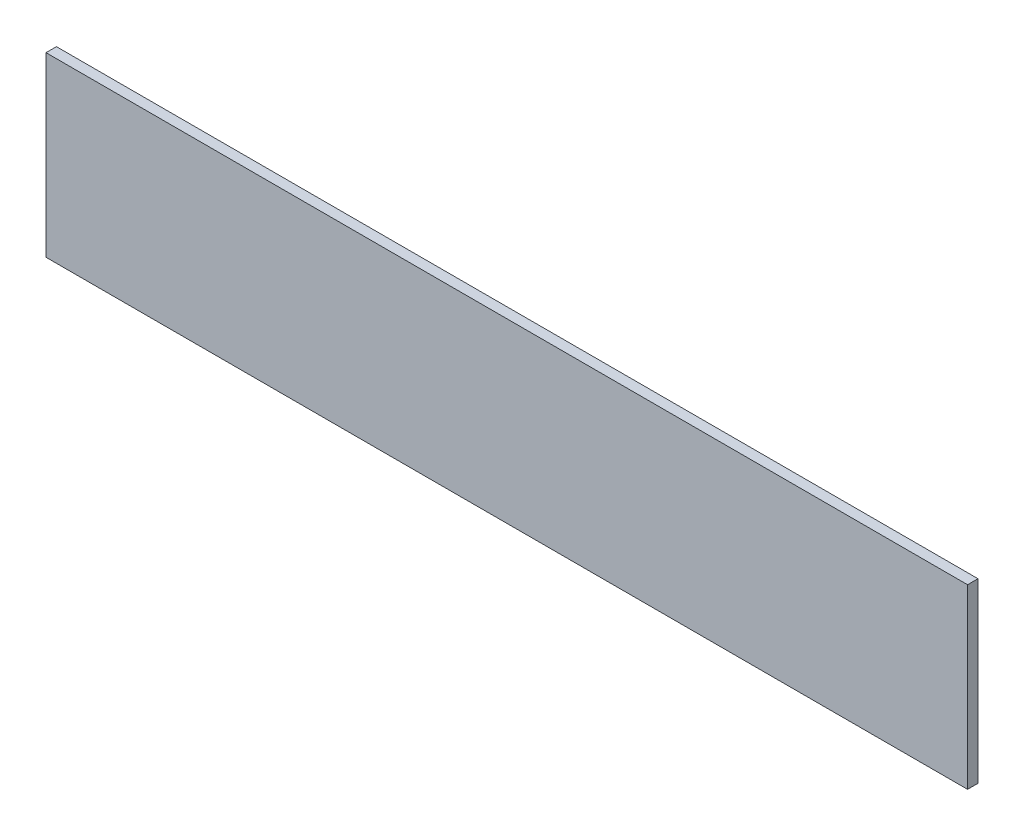
ISO-10303-21;
HEADER;
FILE_DESCRIPTION(('STEP AP214'),'2;1');
FILE_NAME('part.step','',(''),(''),'','','');
FILE_SCHEMA(('AUTOMOTIVE_DESIGN { 1 0 10303 214 1 1 1 1 }'));
ENDSEC;
DATA;
#1=APPLICATION_CONTEXT('core data for automotive mechanical design processes');
#2=APPLICATION_PROTOCOL_DEFINITION('international standard','automotive_design',2000,#1);
#3=PRODUCT_CONTEXT('',#1,'mechanical');
#4=PRODUCT('Part','Part','',(#3));
#5=PRODUCT_RELATED_PRODUCT_CATEGORY('part','',(#4));
#6=PRODUCT_DEFINITION_FORMATION('','',#4);
#7=PRODUCT_DEFINITION_CONTEXT('part definition',#1,'design');
#8=PRODUCT_DEFINITION('design','',#6,#7);
#9=PRODUCT_DEFINITION_SHAPE('','',#8);
#10=(LENGTH_UNIT() NAMED_UNIT(*) SI_UNIT(.MILLI.,.METRE.));
#11=(NAMED_UNIT(*) PLANE_ANGLE_UNIT() SI_UNIT($,.RADIAN.));
#12=(NAMED_UNIT(*) SI_UNIT($,.STERADIAN.) SOLID_ANGLE_UNIT());
#13=UNCERTAINTY_MEASURE_WITH_UNIT(LENGTH_MEASURE(1.E-05),#10,'distance_accuracy_value','');
#14=(GEOMETRIC_REPRESENTATION_CONTEXT(3) GLOBAL_UNCERTAINTY_ASSIGNED_CONTEXT((#13)) GLOBAL_UNIT_ASSIGNED_CONTEXT((#10,
#11,#12)) REPRESENTATION_CONTEXT('',''));
#15=CARTESIAN_POINT('',(0.,0.,0.));
#16=DIRECTION('',(0.,0.,1.));
#17=DIRECTION('',(1.,0.,0.));
#18=AXIS2_PLACEMENT_3D('',#15,#16,#17);
#19=CARTESIAN_POINT('',(-42.1445251800705,-2.63538655559205,1.));
#20=DIRECTION('',(1.,0.,0.));
#21=DIRECTION('',(0.,0.,-1.));
#22=AXIS2_PLACEMENT_3D('',#19,#20,#21);
#23=PLANE('',#22);
#24=DIRECTION('',(0.,-1.,0.));
#25=VECTOR('',#24,1.);
#26=CARTESIAN_POINT('',(-42.1445251800705,-2.63538655559205,0.));
#27=LINE('',#26,#25);
#28=CARTESIAN_POINT('',(-42.1445251800705,-2.63538655559205,0.));
#29=VERTEX_POINT('',#28);
#30=CARTESIAN_POINT('',(-42.1445251800705,-19.635386555592,0.));
#31=VERTEX_POINT('',#30);
#32=EDGE_CURVE('E100',#29,#31,#27,.T.);
#33=ORIENTED_EDGE('',*,*,#32,.T.);
#34=DIRECTION('',(0.,0.,-1.));
#35=VECTOR('',#34,1.);
#36=CARTESIAN_POINT('',(-42.1445251800705,-19.635386555592,1.));
#37=LINE('',#36,#35);
#38=CARTESIAN_POINT('',(-42.1445251800705,-19.635386555592,1.));
#39=VERTEX_POINT('',#38);
#40=EDGE_CURVE('E11',#39,#31,#37,.T.);
#41=ORIENTED_EDGE('',*,*,#40,.F.);
#42=DIRECTION('',(0.,-1.,0.));
#43=VECTOR('',#42,1.);
#44=CARTESIAN_POINT('',(-42.1445251800705,-2.63538655559205,1.));
#45=LINE('',#44,#43);
#46=CARTESIAN_POINT('',(-42.1445251800705,-2.63538655559205,1.));
#47=VERTEX_POINT('',#46);
#48=EDGE_CURVE('E88',#47,#39,#45,.T.);
#49=ORIENTED_EDGE('',*,*,#48,.F.);
#50=DIRECTION('',(0.,0.,-1.));
#51=VECTOR('',#50,1.);
#52=CARTESIAN_POINT('',(-42.1445251800705,-2.63538655559205,1.));
#53=LINE('',#52,#51);
#54=EDGE_CURVE('E96',#47,#29,#53,.T.);
#55=ORIENTED_EDGE('',*,*,#54,.T.);
#56=EDGE_LOOP('',(#33,#41,#49,#55));
#57=FACE_BOUND('',#56,.T.);
#58=ADVANCED_FACE('F37',(#57),#23,.F.);
#59=CARTESIAN_POINT('',(-42.1445251800705,-19.635386555592,1.));
#60=DIRECTION('',(0.,1.,0.));
#61=DIRECTION('',(0.,0.,1.));
#62=AXIS2_PLACEMENT_3D('',#59,#60,#61);
#63=PLANE('',#62);
#64=DIRECTION('',(1.,0.,0.));
#65=VECTOR('',#64,1.);
#66=CARTESIAN_POINT('',(-42.1445251800705,-19.635386555592,0.));
#67=LINE('',#66,#65);
#68=CARTESIAN_POINT('',(46.2554748199295,-19.635386555592,0.));
#69=VERTEX_POINT('',#68);
#70=EDGE_CURVE('E92',#31,#69,#67,.T.);
#71=ORIENTED_EDGE('',*,*,#70,.T.);
#72=DIRECTION('',(0.,0.,-1.));
#73=VECTOR('',#72,1.);
#74=CARTESIAN_POINT('',(46.2554748199295,-19.635386555592,1.));
#75=LINE('',#74,#73);
#76=CARTESIAN_POINT('',(46.2554748199295,-19.635386555592,1.));
#77=VERTEX_POINT('',#76);
#78=EDGE_CURVE('E45',#77,#69,#75,.T.);
#79=ORIENTED_EDGE('',*,*,#78,.F.);
#80=DIRECTION('',(1.,0.,0.));
#81=VECTOR('',#80,1.);
#82=CARTESIAN_POINT('',(-42.1445251800705,-19.635386555592,1.));
#83=LINE('',#82,#81);
#84=EDGE_CURVE('E83',#39,#77,#83,.T.);
#85=ORIENTED_EDGE('',*,*,#84,.F.);
#86=ORIENTED_EDGE('',*,*,#40,.T.);
#87=EDGE_LOOP('',(#71,#79,#85,#86));
#88=FACE_BOUND('',#87,.T.);
#89=ADVANCED_FACE('F91',(#88),#63,.F.);
#90=CARTESIAN_POINT('',(46.2554748199295,-2.63538655559205,1.));
#91=DIRECTION('',(-1.,0.,0.));
#92=DIRECTION('',(0.,-1.,0.));
#93=AXIS2_PLACEMENT_3D('',#90,#91,#92);
#94=PLANE('',#93);
#95=DIRECTION('',(0.,1.,0.));
#96=VECTOR('',#95,1.);
#97=CARTESIAN_POINT('',(46.2554748199295,-2.63538655559205,0.));
#98=LINE('',#97,#96);
#99=CARTESIAN_POINT('',(46.2554748199295,-2.63538655559205,0.));
#100=VERTEX_POINT('',#99);
#101=EDGE_CURVE('E70',#69,#100,#98,.T.);
#102=ORIENTED_EDGE('',*,*,#101,.T.);
#103=DIRECTION('',(0.,0.,-1.));
#104=VECTOR('',#103,1.);
#105=CARTESIAN_POINT('',(46.2554748199295,-2.63538655559205,1.));
#106=LINE('',#105,#104);
#107=CARTESIAN_POINT('',(46.2554748199295,-2.63538655559205,1.));
#108=VERTEX_POINT('',#107);
#109=EDGE_CURVE('E93',#108,#100,#106,.T.);
#110=ORIENTED_EDGE('',*,*,#109,.F.);
#111=DIRECTION('',(0.,1.,0.));
#112=VECTOR('',#111,1.);
#113=CARTESIAN_POINT('',(46.2554748199295,-2.63538655559205,1.));
#114=LINE('',#113,#112);
#115=EDGE_CURVE('E86',#77,#108,#114,.T.);
#116=ORIENTED_EDGE('',*,*,#115,.F.);
#117=ORIENTED_EDGE('',*,*,#78,.T.);
#118=EDGE_LOOP('',(#102,#110,#116,#117));
#119=FACE_BOUND('',#118,.T.);
#120=ADVANCED_FACE('F94',(#119),#94,.F.);
#121=CARTESIAN_POINT('',(-42.1445251800705,-2.63538655559205,1.));
#122=DIRECTION('',(0.,-1.,0.));
#123=DIRECTION('',(0.,0.,-1.));
#124=AXIS2_PLACEMENT_3D('',#121,#122,#123);
#125=PLANE('',#124);
#126=DIRECTION('',(-1.,0.,0.));
#127=VECTOR('',#126,1.);
#128=CARTESIAN_POINT('',(-42.1445251800705,-2.63538655559205,0.));
#129=LINE('',#128,#127);
#130=EDGE_CURVE('E76',#100,#29,#129,.T.);
#131=ORIENTED_EDGE('',*,*,#130,.T.);
#132=ORIENTED_EDGE('',*,*,#54,.F.);
#133=DIRECTION('',(-1.,0.,0.));
#134=VECTOR('',#133,1.);
#135=CARTESIAN_POINT('',(-42.1445251800705,-2.63538655559205,1.));
#136=LINE('',#135,#134);
#137=EDGE_CURVE('E53',#108,#47,#136,.T.);
#138=ORIENTED_EDGE('',*,*,#137,.F.);
#139=ORIENTED_EDGE('',*,*,#109,.T.);
#140=EDGE_LOOP('',(#131,#132,#138,#139));
#141=FACE_BOUND('',#140,.T.);
#142=ADVANCED_FACE('F107',(#141),#125,.F.);
#143=CARTESIAN_POINT('',(0.,0.,1.));
#144=DIRECTION('',(0.,0.,1.));
#145=DIRECTION('',(1.,0.,0.));
#146=AXIS2_PLACEMENT_3D('',#143,#144,#145);
#147=PLANE('',#146);
#148=ORIENTED_EDGE('',*,*,#48,.T.);
#149=ORIENTED_EDGE('',*,*,#84,.T.);
#150=ORIENTED_EDGE('',*,*,#115,.T.);
#151=ORIENTED_EDGE('',*,*,#137,.T.);
#152=EDGE_LOOP('',(#148,#149,#150,#151));
#153=FACE_BOUND('',#152,.T.);
#154=ADVANCED_FACE('F84',(#153),#147,.T.);
#155=CARTESIAN_POINT('',(0.,0.,0.));
#156=DIRECTION('',(0.,0.,1.));
#157=DIRECTION('',(1.,0.,0.));
#158=AXIS2_PLACEMENT_3D('',#155,#156,#157);
#159=PLANE('',#158);
#160=ORIENTED_EDGE('',*,*,#32,.F.);
#161=ORIENTED_EDGE('',*,*,#130,.F.);
#162=ORIENTED_EDGE('',*,*,#101,.F.);
#163=ORIENTED_EDGE('',*,*,#70,.F.);
#164=EDGE_LOOP('',(#160,#161,#162,#163));
#165=FACE_BOUND('',#164,.T.);
#166=ADVANCED_FACE('F110',(#165),#159,.F.);
#167=CLOSED_SHELL('',(#58,#89,#120,#142,#154,#166));
#168=MANIFOLD_SOLID_BREP('B2',#167);
#169=ADVANCED_BREP_SHAPE_REPRESENTATION('',(#18,#168),#14);
#170=SHAPE_DEFINITION_REPRESENTATION(#9,#169);
ENDSEC;
END-ISO-10303-21;
